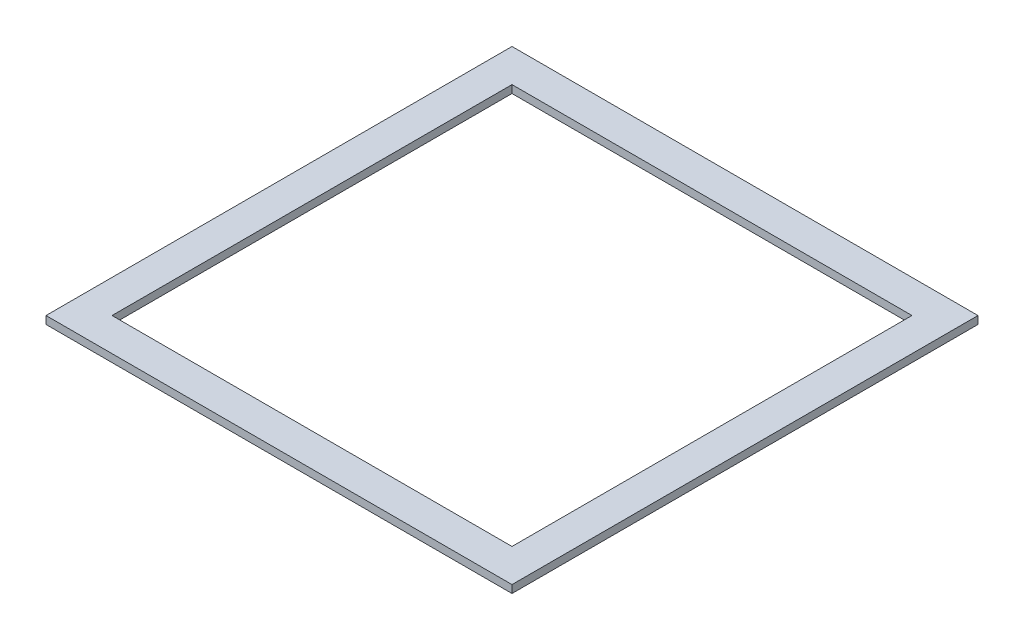
ISO-10303-21;
HEADER;
FILE_DESCRIPTION(('STEP AP214'),'2;1');
FILE_NAME('part.step','',(''),(''),'','','');
FILE_SCHEMA(('AUTOMOTIVE_DESIGN { 1 0 10303 214 1 1 1 1 }'));
ENDSEC;
DATA;
#1=APPLICATION_CONTEXT('core data for automotive mechanical design processes');
#2=APPLICATION_PROTOCOL_DEFINITION('international standard','automotive_design',2000,#1);
#3=PRODUCT_CONTEXT('',#1,'mechanical');
#4=PRODUCT('Part','Part','',(#3));
#5=PRODUCT_RELATED_PRODUCT_CATEGORY('part','',(#4));
#6=PRODUCT_DEFINITION_FORMATION('','',#4);
#7=PRODUCT_DEFINITION_CONTEXT('part definition',#1,'design');
#8=PRODUCT_DEFINITION('design','',#6,#7);
#9=PRODUCT_DEFINITION_SHAPE('','',#8);
#10=(LENGTH_UNIT() NAMED_UNIT(*) SI_UNIT(.MILLI.,.METRE.));
#11=(NAMED_UNIT(*) PLANE_ANGLE_UNIT() SI_UNIT($,.RADIAN.));
#12=(NAMED_UNIT(*) SI_UNIT($,.STERADIAN.) SOLID_ANGLE_UNIT());
#13=UNCERTAINTY_MEASURE_WITH_UNIT(LENGTH_MEASURE(1.E-05),#10,'distance_accuracy_value','');
#14=(GEOMETRIC_REPRESENTATION_CONTEXT(3) GLOBAL_UNCERTAINTY_ASSIGNED_CONTEXT((#13)) GLOBAL_UNIT_ASSIGNED_CONTEXT((#10,
#11,#12)) REPRESENTATION_CONTEXT('',''));
#15=CARTESIAN_POINT('',(0.,0.,0.));
#16=DIRECTION('',(0.,0.,1.));
#17=DIRECTION('',(1.,0.,0.));
#18=AXIS2_PLACEMENT_3D('',#15,#16,#17);
#19=CARTESIAN_POINT('',(300.,10.,-300.));
#20=DIRECTION('',(-1.,0.,0.));
#21=DIRECTION('',(0.,0.,1.));
#22=AXIS2_PLACEMENT_3D('',#19,#20,#21);
#23=PLANE('',#22);
#24=DIRECTION('',(0.,0.,-1.));
#25=VECTOR('',#24,1.);
#26=CARTESIAN_POINT('',(300.,0.,-300.));
#27=LINE('',#26,#25);
#28=CARTESIAN_POINT('',(300.,0.,300.));
#29=VERTEX_POINT('',#28);
#30=CARTESIAN_POINT('',(300.,0.,-300.));
#31=VERTEX_POINT('',#30);
#32=EDGE_CURVE('E131',#29,#31,#27,.T.);
#33=ORIENTED_EDGE('',*,*,#32,.T.);
#34=DIRECTION('',(0.,-1.,0.));
#35=VECTOR('',#34,1.);
#36=CARTESIAN_POINT('',(300.,10.,-300.));
#37=LINE('',#36,#35);
#38=CARTESIAN_POINT('',(300.,10.,-300.));
#39=VERTEX_POINT('',#38);
#40=EDGE_CURVE('E11',#39,#31,#37,.T.);
#41=ORIENTED_EDGE('',*,*,#40,.F.);
#42=DIRECTION('',(0.,0.,-1.));
#43=VECTOR('',#42,1.);
#44=CARTESIAN_POINT('',(300.,10.,-300.));
#45=LINE('',#44,#43);
#46=CARTESIAN_POINT('',(300.,10.,300.));
#47=VERTEX_POINT('',#46);
#48=EDGE_CURVE('E135',#47,#39,#45,.T.);
#49=ORIENTED_EDGE('',*,*,#48,.F.);
#50=DIRECTION('',(0.,-1.,0.));
#51=VECTOR('',#50,1.);
#52=CARTESIAN_POINT('',(300.,10.,300.));
#53=LINE('',#52,#51);
#54=EDGE_CURVE('E145',#47,#29,#53,.T.);
#55=ORIENTED_EDGE('',*,*,#54,.T.);
#56=EDGE_LOOP('',(#33,#41,#49,#55));
#57=FACE_BOUND('',#56,.T.);
#58=ADVANCED_FACE('F34',(#57),#23,.F.);
#59=CARTESIAN_POINT('',(-300.,10.,-300.));
#60=DIRECTION('',(0.,0.,1.));
#61=DIRECTION('',(1.,0.,0.));
#62=AXIS2_PLACEMENT_3D('',#59,#60,#61);
#63=PLANE('',#62);
#64=DIRECTION('',(-1.,0.,0.));
#65=VECTOR('',#64,1.);
#66=CARTESIAN_POINT('',(-300.,0.,-300.));
#67=LINE('',#66,#65);
#68=CARTESIAN_POINT('',(-300.,0.,-300.));
#69=VERTEX_POINT('',#68);
#70=EDGE_CURVE('E148',#31,#69,#67,.T.);
#71=ORIENTED_EDGE('',*,*,#70,.T.);
#72=DIRECTION('',(0.,-1.,0.));
#73=VECTOR('',#72,1.);
#74=CARTESIAN_POINT('',(-300.,10.,-300.));
#75=LINE('',#74,#73);
#76=CARTESIAN_POINT('',(-300.,10.,-300.));
#77=VERTEX_POINT('',#76);
#78=EDGE_CURVE('E41',#77,#69,#75,.T.);
#79=ORIENTED_EDGE('',*,*,#78,.F.);
#80=DIRECTION('',(-1.,0.,0.));
#81=VECTOR('',#80,1.);
#82=CARTESIAN_POINT('',(-300.,10.,-300.));
#83=LINE('',#82,#81);
#84=EDGE_CURVE('E138',#39,#77,#83,.T.);
#85=ORIENTED_EDGE('',*,*,#84,.F.);
#86=ORIENTED_EDGE('',*,*,#40,.T.);
#87=EDGE_LOOP('',(#71,#79,#85,#86));
#88=FACE_BOUND('',#87,.T.);
#89=ADVANCED_FACE('F176',(#88),#63,.F.);
#90=CARTESIAN_POINT('',(-300.,10.,-300.));
#91=DIRECTION('',(1.,0.,0.));
#92=DIRECTION('',(0.,0.,-1.));
#93=AXIS2_PLACEMENT_3D('',#90,#91,#92);
#94=PLANE('',#93);
#95=DIRECTION('',(0.,0.,1.));
#96=VECTOR('',#95,1.);
#97=CARTESIAN_POINT('',(-300.,0.,-300.));
#98=LINE('',#97,#96);
#99=CARTESIAN_POINT('',(-300.,0.,300.));
#100=VERTEX_POINT('',#99);
#101=EDGE_CURVE('E150',#69,#100,#98,.T.);
#102=ORIENTED_EDGE('',*,*,#101,.T.);
#103=DIRECTION('',(0.,-1.,0.));
#104=VECTOR('',#103,1.);
#105=CARTESIAN_POINT('',(-300.,10.,300.));
#106=LINE('',#105,#104);
#107=CARTESIAN_POINT('',(-300.,10.,300.));
#108=VERTEX_POINT('',#107);
#109=EDGE_CURVE('E155',#108,#100,#106,.T.);
#110=ORIENTED_EDGE('',*,*,#109,.F.);
#111=DIRECTION('',(0.,0.,1.));
#112=VECTOR('',#111,1.);
#113=CARTESIAN_POINT('',(-300.,10.,-300.));
#114=LINE('',#113,#112);
#115=EDGE_CURVE('E141',#77,#108,#114,.T.);
#116=ORIENTED_EDGE('',*,*,#115,.F.);
#117=ORIENTED_EDGE('',*,*,#78,.T.);
#118=EDGE_LOOP('',(#102,#110,#116,#117));
#119=FACE_BOUND('',#118,.T.);
#120=ADVANCED_FACE('F162',(#119),#94,.F.);
#121=CARTESIAN_POINT('',(-300.,10.,300.));
#122=DIRECTION('',(0.,0.,-1.));
#123=DIRECTION('',(-1.,0.,0.));
#124=AXIS2_PLACEMENT_3D('',#121,#122,#123);
#125=PLANE('',#124);
#126=DIRECTION('',(1.,0.,0.));
#127=VECTOR('',#126,1.);
#128=CARTESIAN_POINT('',(-300.,0.,300.));
#129=LINE('',#128,#127);
#130=EDGE_CURVE('E139',#100,#29,#129,.T.);
#131=ORIENTED_EDGE('',*,*,#130,.T.);
#132=ORIENTED_EDGE('',*,*,#54,.F.);
#133=DIRECTION('',(1.,0.,0.));
#134=VECTOR('',#133,1.);
#135=CARTESIAN_POINT('',(-300.,10.,300.));
#136=LINE('',#135,#134);
#137=EDGE_CURVE('E143',#108,#47,#136,.T.);
#138=ORIENTED_EDGE('',*,*,#137,.F.);
#139=ORIENTED_EDGE('',*,*,#109,.T.);
#140=EDGE_LOOP('',(#131,#132,#138,#139));
#141=FACE_BOUND('',#140,.T.);
#142=ADVANCED_FACE('F169',(#141),#125,.F.);
#143=CARTESIAN_POINT('',(0.,10.,0.));
#144=DIRECTION('',(0.,1.,0.));
#145=DIRECTION('',(0.,0.,1.));
#146=AXIS2_PLACEMENT_3D('',#143,#144,#145);
#147=PLANE('',#146);
#148=DIRECTION('',(0.,0.,-1.));
#149=VECTOR('',#148,1.);
#150=CARTESIAN_POINT('',(257.5,10.,-257.5));
#151=LINE('',#150,#149);
#152=CARTESIAN_POINT('',(257.5,10.,257.5));
#153=VERTEX_POINT('',#152);
#154=CARTESIAN_POINT('',(257.5,10.,-257.5));
#155=VERTEX_POINT('',#154);
#156=EDGE_CURVE('E48',#153,#155,#151,.T.);
#157=ORIENTED_EDGE('',*,*,#156,.F.);
#158=DIRECTION('',(1.,0.,0.));
#159=VECTOR('',#158,1.);
#160=CARTESIAN_POINT('',(-257.5,10.,257.5));
#161=LINE('',#160,#159);
#162=CARTESIAN_POINT('',(-257.5,10.,257.5));
#163=VERTEX_POINT('',#162);
#164=EDGE_CURVE('E116',#163,#153,#161,.T.);
#165=ORIENTED_EDGE('',*,*,#164,.F.);
#166=DIRECTION('',(0.,0.,1.));
#167=VECTOR('',#166,1.);
#168=CARTESIAN_POINT('',(-257.5,10.,-257.5));
#169=LINE('',#168,#167);
#170=CARTESIAN_POINT('',(-257.5,10.,-257.5));
#171=VERTEX_POINT('',#170);
#172=EDGE_CURVE('E119',#171,#163,#169,.T.);
#173=ORIENTED_EDGE('',*,*,#172,.F.);
#174=DIRECTION('',(-1.,0.,0.));
#175=VECTOR('',#174,1.);
#176=CARTESIAN_POINT('',(-257.5,10.,-257.5));
#177=LINE('',#176,#175);
#178=EDGE_CURVE('E125',#155,#171,#177,.T.);
#179=ORIENTED_EDGE('',*,*,#178,.F.);
#180=EDGE_LOOP('',(#157,#165,#173,#179));
#181=FACE_BOUND('',#180,.T.);
#182=ORIENTED_EDGE('',*,*,#48,.T.);
#183=ORIENTED_EDGE('',*,*,#84,.T.);
#184=ORIENTED_EDGE('',*,*,#115,.T.);
#185=ORIENTED_EDGE('',*,*,#137,.T.);
#186=EDGE_LOOP('',(#182,#183,#184,#185));
#187=FACE_BOUND('',#186,.T.);
#188=ADVANCED_FACE('F175',(#181,#187),#147,.T.);
#189=CARTESIAN_POINT('',(0.,0.,0.));
#190=DIRECTION('',(0.,1.,0.));
#191=DIRECTION('',(0.,0.,1.));
#192=AXIS2_PLACEMENT_3D('',#189,#190,#191);
#193=PLANE('',#192);
#194=DIRECTION('',(1.,0.,0.));
#195=VECTOR('',#194,1.);
#196=CARTESIAN_POINT('',(-257.5,0.,257.5));
#197=LINE('',#196,#195);
#198=CARTESIAN_POINT('',(-257.5,0.,257.5));
#199=VERTEX_POINT('',#198);
#200=CARTESIAN_POINT('',(257.5,0.,257.5));
#201=VERTEX_POINT('',#200);
#202=EDGE_CURVE('E106',#199,#201,#197,.T.);
#203=ORIENTED_EDGE('',*,*,#202,.T.);
#204=DIRECTION('',(0.,0.,-1.));
#205=VECTOR('',#204,1.);
#206=CARTESIAN_POINT('',(257.5,0.,-257.5));
#207=LINE('',#206,#205);
#208=CARTESIAN_POINT('',(257.5,0.,-257.5));
#209=VERTEX_POINT('',#208);
#210=EDGE_CURVE('E100',#201,#209,#207,.T.);
#211=ORIENTED_EDGE('',*,*,#210,.T.);
#212=DIRECTION('',(-1.,0.,0.));
#213=VECTOR('',#212,1.);
#214=CARTESIAN_POINT('',(-257.5,0.,-257.5));
#215=LINE('',#214,#213);
#216=CARTESIAN_POINT('',(-257.5,0.,-257.5));
#217=VERTEX_POINT('',#216);
#218=EDGE_CURVE('E109',#209,#217,#215,.T.);
#219=ORIENTED_EDGE('',*,*,#218,.T.);
#220=DIRECTION('',(0.,0.,1.));
#221=VECTOR('',#220,1.);
#222=CARTESIAN_POINT('',(-257.5,0.,-257.5));
#223=LINE('',#222,#221);
#224=EDGE_CURVE('E56',#217,#199,#223,.T.);
#225=ORIENTED_EDGE('',*,*,#224,.T.);
#226=EDGE_LOOP('',(#203,#211,#219,#225));
#227=FACE_BOUND('',#226,.T.);
#228=ORIENTED_EDGE('',*,*,#32,.F.);
#229=ORIENTED_EDGE('',*,*,#130,.F.);
#230=ORIENTED_EDGE('',*,*,#101,.F.);
#231=ORIENTED_EDGE('',*,*,#70,.F.);
#232=EDGE_LOOP('',(#228,#229,#230,#231));
#233=FACE_BOUND('',#232,.T.);
#234=ADVANCED_FACE('F113',(#227,#233),#193,.F.);
#235=CARTESIAN_POINT('',(257.5,0.,-257.5));
#236=DIRECTION('',(1.,0.,0.));
#237=DIRECTION('',(0.,0.,-1.));
#238=AXIS2_PLACEMENT_3D('',#235,#236,#237);
#239=PLANE('',#238);
#240=ORIENTED_EDGE('',*,*,#156,.T.);
#241=DIRECTION('',(0.,1.,0.));
#242=VECTOR('',#241,1.);
#243=CARTESIAN_POINT('',(257.5,0.,-257.5));
#244=LINE('',#243,#242);
#245=EDGE_CURVE('E96',#209,#155,#244,.T.);
#246=ORIENTED_EDGE('',*,*,#245,.F.);
#247=ORIENTED_EDGE('',*,*,#210,.F.);
#248=DIRECTION('',(0.,1.,0.));
#249=VECTOR('',#248,1.);
#250=CARTESIAN_POINT('',(257.5,0.,257.5));
#251=LINE('',#250,#249);
#252=EDGE_CURVE('E129',#201,#153,#251,.T.);
#253=ORIENTED_EDGE('',*,*,#252,.T.);
#254=EDGE_LOOP('',(#240,#246,#247,#253));
#255=FACE_BOUND('',#254,.T.);
#256=ADVANCED_FACE('F98',(#255),#239,.F.);
#257=CARTESIAN_POINT('',(-257.5,0.,257.5));
#258=DIRECTION('',(0.,0.,1.));
#259=DIRECTION('',(1.,0.,0.));
#260=AXIS2_PLACEMENT_3D('',#257,#258,#259);
#261=PLANE('',#260);
#262=ORIENTED_EDGE('',*,*,#164,.T.);
#263=ORIENTED_EDGE('',*,*,#252,.F.);
#264=ORIENTED_EDGE('',*,*,#202,.F.);
#265=DIRECTION('',(0.,1.,0.));
#266=VECTOR('',#265,1.);
#267=CARTESIAN_POINT('',(-257.5,0.,257.5));
#268=LINE('',#267,#266);
#269=EDGE_CURVE('E132',#199,#163,#268,.T.);
#270=ORIENTED_EDGE('',*,*,#269,.T.);
#271=EDGE_LOOP('',(#262,#263,#264,#270));
#272=FACE_BOUND('',#271,.T.);
#273=ADVANCED_FACE('F193',(#272),#261,.F.);
#274=CARTESIAN_POINT('',(-257.5,0.,-257.5));
#275=DIRECTION('',(-1.,0.,0.));
#276=DIRECTION('',(0.,0.,1.));
#277=AXIS2_PLACEMENT_3D('',#274,#275,#276);
#278=PLANE('',#277);
#279=ORIENTED_EDGE('',*,*,#172,.T.);
#280=ORIENTED_EDGE('',*,*,#269,.F.);
#281=ORIENTED_EDGE('',*,*,#224,.F.);
#282=DIRECTION('',(0.,1.,0.));
#283=VECTOR('',#282,1.);
#284=CARTESIAN_POINT('',(-257.5,0.,-257.5));
#285=LINE('',#284,#283);
#286=EDGE_CURVE('E105',#217,#171,#285,.T.);
#287=ORIENTED_EDGE('',*,*,#286,.T.);
#288=EDGE_LOOP('',(#279,#280,#281,#287));
#289=FACE_BOUND('',#288,.T.);
#290=ADVANCED_FACE('F196',(#289),#278,.F.);
#291=CARTESIAN_POINT('',(-257.5,0.,-257.5));
#292=DIRECTION('',(0.,0.,-1.));
#293=DIRECTION('',(-1.,0.,0.));
#294=AXIS2_PLACEMENT_3D('',#291,#292,#293);
#295=PLANE('',#294);
#296=ORIENTED_EDGE('',*,*,#178,.T.);
#297=ORIENTED_EDGE('',*,*,#286,.F.);
#298=ORIENTED_EDGE('',*,*,#218,.F.);
#299=ORIENTED_EDGE('',*,*,#245,.T.);
#300=EDGE_LOOP('',(#296,#297,#298,#299));
#301=FACE_BOUND('',#300,.T.);
#302=ADVANCED_FACE('F110',(#301),#295,.F.);
#303=CLOSED_SHELL('',(#58,#89,#120,#142,#188,#234,#256,#273,#290,#302));
#304=MANIFOLD_SOLID_BREP('B2',#303);
#305=ADVANCED_BREP_SHAPE_REPRESENTATION('',(#18,#304),#14);
#306=SHAPE_DEFINITION_REPRESENTATION(#9,#305);
ENDSEC;
END-ISO-10303-21;
